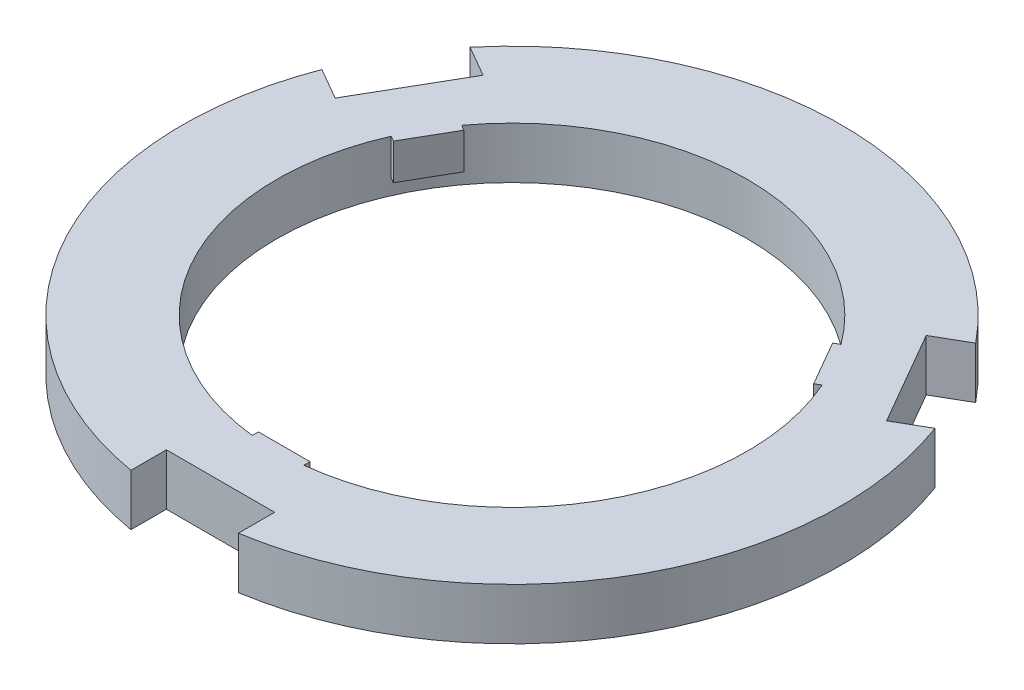
ISO-10303-21;
HEADER;
FILE_DESCRIPTION(('STEP AP214'),'2;1');
FILE_NAME('part.step','',(''),(''),'','','');
FILE_SCHEMA(('AUTOMOTIVE_DESIGN { 1 0 10303 214 1 1 1 1 }'));
ENDSEC;
DATA;
#1=APPLICATION_CONTEXT('core data for automotive mechanical design processes');
#2=APPLICATION_PROTOCOL_DEFINITION('international standard','automotive_design',2000,#1);
#3=PRODUCT_CONTEXT('',#1,'mechanical');
#4=PRODUCT('Part','Part','',(#3));
#5=PRODUCT_RELATED_PRODUCT_CATEGORY('part','',(#4));
#6=PRODUCT_DEFINITION_FORMATION('','',#4);
#7=PRODUCT_DEFINITION_CONTEXT('part definition',#1,'design');
#8=PRODUCT_DEFINITION('design','',#6,#7);
#9=PRODUCT_DEFINITION_SHAPE('','',#8);
#10=(LENGTH_UNIT() NAMED_UNIT(*) SI_UNIT(.MILLI.,.METRE.));
#11=(NAMED_UNIT(*) PLANE_ANGLE_UNIT() SI_UNIT($,.RADIAN.));
#12=(NAMED_UNIT(*) SI_UNIT($,.STERADIAN.) SOLID_ANGLE_UNIT());
#13=UNCERTAINTY_MEASURE_WITH_UNIT(LENGTH_MEASURE(1.E-05),#10,'distance_accuracy_value','');
#14=(GEOMETRIC_REPRESENTATION_CONTEXT(3) GLOBAL_UNCERTAINTY_ASSIGNED_CONTEXT((#13)) GLOBAL_UNIT_ASSIGNED_CONTEXT((#10,
#11,#12)) REPRESENTATION_CONTEXT('',''));
#15=CARTESIAN_POINT('',(0.,0.,0.));
#16=DIRECTION('',(0.,0.,1.));
#17=DIRECTION('',(1.,0.,0.));
#18=AXIS2_PLACEMENT_3D('',#15,#16,#17);
#19=CARTESIAN_POINT('',(0.,3.,0.));
#20=DIRECTION('',(0.,-1.,0.));
#21=DIRECTION('',(0.,0.,-1.));
#22=AXIS2_PLACEMENT_3D('',#19,#20,#21);
#23=CYLINDRICAL_SURFACE('',#22,22.8495146289497);
#24=DIRECTION('',(0.,1.,0.));
#25=VECTOR('',#24,1.);
#26=CARTESIAN_POINT('',(-18.4179175818093,-0.5,-13.5233365235163));
#27=LINE('',#26,#25);
#28=CARTESIAN_POINT('',(-18.4179175818093,-0.5,-13.5233365235162));
#29=VERTEX_POINT('',#28);
#30=CARTESIAN_POINT('',(-18.4179175818093,3.,-13.5233365235163));
#31=VERTEX_POINT('',#30);
#32=EDGE_CURVE('E68',#29,#31,#27,.T.);
#33=ORIENTED_EDGE('',*,*,#32,.F.);
#34=CARTESIAN_POINT('',(0.,-0.5,0.));
#35=DIRECTION('',(0.,1.,0.));
#36=DIRECTION('',(0.,0.,1.));
#37=AXIS2_PLACEMENT_3D('',#34,#35,#36);
#38=CIRCLE('',#37,22.8495146289497);
#39=CARTESIAN_POINT('',(-20.9205117641957,-0.5,-9.18871624889676));
#40=VERTEX_POINT('',#39);
#41=EDGE_CURVE('E63',#29,#40,#38,.T.);
#42=ORIENTED_EDGE('',*,*,#41,.T.);
#43=DIRECTION('',(0.,1.,0.));
#44=VECTOR('',#43,1.);
#45=CARTESIAN_POINT('',(-20.9205117641957,-0.5,-9.18871624889676));
#46=LINE('',#45,#44);
#47=CARTESIAN_POINT('',(-20.9205117641957,3.,-9.18871624889676));
#48=VERTEX_POINT('',#47);
#49=EDGE_CURVE('E223',#40,#48,#46,.T.);
#50=ORIENTED_EDGE('',*,*,#49,.T.);
#51=CARTESIAN_POINT('',(0.,3.,0.));
#52=DIRECTION('',(0.,1.,0.));
#53=DIRECTION('',(0.,0.,1.));
#54=AXIS2_PLACEMENT_3D('',#51,#52,#53);
#55=CIRCLE('',#54,22.8495146289497);
#56=CARTESIAN_POINT('',(-2.50259418238637,3.,22.712052772413));
#57=VERTEX_POINT('',#56);
#58=EDGE_CURVE('E207',#48,#57,#55,.T.);
#59=ORIENTED_EDGE('',*,*,#58,.T.);
#60=DIRECTION('',(0.,-1.,0.));
#61=VECTOR('',#60,1.);
#62=CARTESIAN_POINT('',(-2.50259418238637,3.,22.712052772413));
#63=LINE('',#62,#61);
#64=CARTESIAN_POINT('',(-2.50259418238637,-0.5,22.712052772413));
#65=VERTEX_POINT('',#64);
#66=EDGE_CURVE('E335',#57,#65,#63,.T.);
#67=ORIENTED_EDGE('',*,*,#66,.T.);
#68=CARTESIAN_POINT('',(0.,-0.5,0.));
#69=DIRECTION('',(0.,1.,0.));
#70=DIRECTION('',(0.,0.,1.));
#71=AXIS2_PLACEMENT_3D('',#68,#69,#70);
#72=CIRCLE('',#71,22.8495146289497);
#73=CARTESIAN_POINT('',(2.50259418238637,-0.5,22.712052772413));
#74=VERTEX_POINT('',#73);
#75=EDGE_CURVE('E311',#65,#74,#72,.T.);
#76=ORIENTED_EDGE('',*,*,#75,.T.);
#77=DIRECTION('',(0.,-1.,0.));
#78=VECTOR('',#77,1.);
#79=CARTESIAN_POINT('',(2.50259418238637,3.,22.712052772413));
#80=LINE('',#79,#78);
#81=CARTESIAN_POINT('',(2.50259418238637,3.,22.712052772413));
#82=VERTEX_POINT('',#81);
#83=EDGE_CURVE('E331',#82,#74,#80,.T.);
#84=ORIENTED_EDGE('',*,*,#83,.F.);
#85=CARTESIAN_POINT('',(20.9205117641956,3.,-9.18871624889678));
#86=VERTEX_POINT('',#85);
#87=EDGE_CURVE('E221',#82,#86,#55,.T.);
#88=ORIENTED_EDGE('',*,*,#87,.T.);
#89=DIRECTION('',(0.,-1.,0.));
#90=VECTOR('',#89,1.);
#91=CARTESIAN_POINT('',(20.9205117641956,3.,-9.18871624889678));
#92=LINE('',#91,#90);
#93=CARTESIAN_POINT('',(20.9205117641956,-0.5,-9.18871624889677));
#94=VERTEX_POINT('',#93);
#95=EDGE_CURVE('E241',#86,#94,#92,.T.);
#96=ORIENTED_EDGE('',*,*,#95,.T.);
#97=CARTESIAN_POINT('',(0.,-0.5,0.));
#98=DIRECTION('',(0.,1.,0.));
#99=DIRECTION('',(0.,0.,1.));
#100=AXIS2_PLACEMENT_3D('',#97,#98,#99);
#101=CIRCLE('',#100,22.8495146289497);
#102=CARTESIAN_POINT('',(18.4179175818093,-0.5,-13.5233365235163));
#103=VERTEX_POINT('',#102);
#104=EDGE_CURVE('E267',#94,#103,#101,.T.);
#105=ORIENTED_EDGE('',*,*,#104,.T.);
#106=DIRECTION('',(0.,-1.,0.));
#107=VECTOR('',#106,1.);
#108=CARTESIAN_POINT('',(18.4179175818093,3.,-13.5233365235163));
#109=LINE('',#108,#107);
#110=CARTESIAN_POINT('',(18.4179175818093,3.,-13.5233365235163));
#111=VERTEX_POINT('',#110);
#112=EDGE_CURVE('E297',#111,#103,#109,.T.);
#113=ORIENTED_EDGE('',*,*,#112,.F.);
#114=EDGE_CURVE('E218',#111,#31,#55,.T.);
#115=ORIENTED_EDGE('',*,*,#114,.T.);
#116=EDGE_LOOP('',(#33,#42,#50,#59,#67,#76,#84,#88,#96,#105,#113,#115));
#117=FACE_BOUND('',#116,.T.);
#118=CARTESIAN_POINT('',(0.,-2.,0.));
#119=DIRECTION('',(0.,1.,0.));
#120=DIRECTION('',(0.,0.,1.));
#121=AXIS2_PLACEMENT_3D('',#118,#119,#120);
#122=CIRCLE('',#121,22.8495146289497);
#123=CARTESIAN_POINT('',(0.,-2.,22.8495146289497));
#124=VERTEX_POINT('',#123);
#125=EDGE_CURVE('E387',#124,#124,#122,.T.);
#126=ORIENTED_EDGE('',*,*,#125,.F.);
#127=EDGE_LOOP('',(#126));
#128=FACE_BOUND('',#127,.T.);
#129=ADVANCED_FACE('F47',(#117,#128),#23,.F.);
#130=CARTESIAN_POINT('',(-5.46649150767487,3.,0.));
#131=DIRECTION('',(1.,0.,0.));
#132=DIRECTION('',(0.,0.,-1.));
#133=AXIS2_PLACEMENT_3D('',#130,#131,#132);
#134=PLANE('',#133);
#135=DIRECTION('',(0.,-1.,0.));
#136=VECTOR('',#135,1.);
#137=CARTESIAN_POINT('',(-5.46649150767492,3.,31.5296284563665));
#138=LINE('',#137,#136);
#139=CARTESIAN_POINT('',(-5.46649150767492,3.,31.5296284563665));
#140=VERTEX_POINT('',#139);
#141=CARTESIAN_POINT('',(-5.46649150767492,-2.,31.5296284563665));
#142=VERTEX_POINT('',#141);
#143=EDGE_CURVE('E430',#140,#142,#138,.T.);
#144=ORIENTED_EDGE('',*,*,#143,.T.);
#145=DIRECTION('',(0.,0.,1.));
#146=VECTOR('',#145,1.);
#147=CARTESIAN_POINT('',(-5.46649150767487,-2.,0.));
#148=LINE('',#147,#146);
#149=CARTESIAN_POINT('',(-5.46649150767492,-2.,28.0858274148198));
#150=VERTEX_POINT('',#149);
#151=EDGE_CURVE('E258',#150,#142,#148,.T.);
#152=ORIENTED_EDGE('',*,*,#151,.F.);
#153=DIRECTION('',(0.,-1.,0.));
#154=VECTOR('',#153,1.);
#155=CARTESIAN_POINT('',(-5.46649150767492,3.,28.0858274148198));
#156=LINE('',#155,#154);
#157=CARTESIAN_POINT('',(-5.46649150767492,3.,28.0858274148198));
#158=VERTEX_POINT('',#157);
#159=EDGE_CURVE('E11',#158,#150,#156,.T.);
#160=ORIENTED_EDGE('',*,*,#159,.F.);
#161=DIRECTION('',(0.,0.,1.));
#162=VECTOR('',#161,1.);
#163=CARTESIAN_POINT('',(-5.46649150767487,3.,0.));
#164=LINE('',#163,#162);
#165=EDGE_CURVE('E391',#158,#140,#164,.T.);
#166=ORIENTED_EDGE('',*,*,#165,.T.);
#167=EDGE_LOOP('',(#144,#152,#160,#166));
#168=FACE_BOUND('',#167,.T.);
#169=ADVANCED_FACE('F49',(#168),#134,.T.);
#170=CARTESIAN_POINT('',(0.,3.,28.0858274148198));
#171=DIRECTION('',(0.,0.,-1.));
#172=DIRECTION('',(-1.,0.,0.));
#173=AXIS2_PLACEMENT_3D('',#170,#171,#172);
#174=PLANE('',#173);
#175=ORIENTED_EDGE('',*,*,#159,.T.);
#176=DIRECTION('',(1.,0.,0.));
#177=VECTOR('',#176,1.);
#178=CARTESIAN_POINT('',(0.,-2.,28.0858274148198));
#179=LINE('',#178,#177);
#180=CARTESIAN_POINT('',(5.04054777636176,-2.,28.0858274148198));
#181=VERTEX_POINT('',#180);
#182=EDGE_CURVE('E343',#150,#181,#179,.T.);
#183=ORIENTED_EDGE('',*,*,#182,.T.);
#184=DIRECTION('',(0.,-1.,0.));
#185=VECTOR('',#184,1.);
#186=CARTESIAN_POINT('',(5.04054777636176,3.,28.0858274148198));
#187=LINE('',#186,#185);
#188=CARTESIAN_POINT('',(5.04054777636176,3.,28.0858274148198));
#189=VERTEX_POINT('',#188);
#190=EDGE_CURVE('E56',#189,#181,#187,.T.);
#191=ORIENTED_EDGE('',*,*,#190,.F.);
#192=DIRECTION('',(1.,0.,0.));
#193=VECTOR('',#192,1.);
#194=CARTESIAN_POINT('',(0.,3.,28.0858274148198));
#195=LINE('',#194,#193);
#196=EDGE_CURVE('E395',#158,#189,#195,.T.);
#197=ORIENTED_EDGE('',*,*,#196,.F.);
#198=EDGE_LOOP('',(#175,#183,#191,#197));
#199=FACE_BOUND('',#198,.T.);
#200=ADVANCED_FACE('F473',(#199),#174,.F.);
#201=CARTESIAN_POINT('',(5.04054777636174,3.,0.));
#202=DIRECTION('',(1.,0.,0.));
#203=DIRECTION('',(0.,0.,-1.));
#204=AXIS2_PLACEMENT_3D('',#201,#202,#203);
#205=PLANE('',#204);
#206=ORIENTED_EDGE('',*,*,#190,.T.);
#207=DIRECTION('',(0.,0.,1.));
#208=VECTOR('',#207,1.);
#209=CARTESIAN_POINT('',(5.04054777636174,-2.,0.));
#210=LINE('',#209,#208);
#211=CARTESIAN_POINT('',(5.04054777636177,-2.,31.6005202190441));
#212=VERTEX_POINT('',#211);
#213=EDGE_CURVE('E347',#181,#212,#210,.T.);
#214=ORIENTED_EDGE('',*,*,#213,.T.);
#215=DIRECTION('',(0.,-1.,0.));
#216=VECTOR('',#215,1.);
#217=CARTESIAN_POINT('',(5.04054777636177,3.,31.6005202190441));
#218=LINE('',#217,#216);
#219=CARTESIAN_POINT('',(5.04054777636177,3.,31.6005202190441));
#220=VERTEX_POINT('',#219);
#221=EDGE_CURVE('E457',#220,#212,#218,.T.);
#222=ORIENTED_EDGE('',*,*,#221,.F.);
#223=DIRECTION('',(0.,0.,1.));
#224=VECTOR('',#223,1.);
#225=CARTESIAN_POINT('',(5.04054777636174,3.,0.));
#226=LINE('',#225,#224);
#227=EDGE_CURVE('E398',#189,#220,#226,.T.);
#228=ORIENTED_EDGE('',*,*,#227,.F.);
#229=EDGE_LOOP('',(#206,#214,#222,#228));
#230=FACE_BOUND('',#229,.T.);
#231=ADVANCED_FACE('F464',(#230),#205,.F.);
#232=CARTESIAN_POINT('',(0.,3.,-2.84494650060196E-13));
#233=DIRECTION('',(0.,-1.,0.));
#234=DIRECTION('',(0.,0.,-1.));
#235=AXIS2_PLACEMENT_3D('',#232,#233,#234);
#236=CYLINDRICAL_SURFACE('',#235,32.0000000000001);
#237=ORIENTED_EDGE('',*,*,#221,.T.);
#238=CARTESIAN_POINT('',(0.,-2.,-2.84494650060196E-13));
#239=DIRECTION('',(0.,1.,0.));
#240=DIRECTION('',(0.,0.,1.));
#241=AXIS2_PLACEMENT_3D('',#238,#239,#240);
#242=CIRCLE('',#241,32.0000000000001);
#243=CARTESIAN_POINT('',(30.0387049689356,-2.,-11.0306937129649));
#244=VERTEX_POINT('',#243);
#245=EDGE_CURVE('E351',#212,#244,#242,.T.);
#246=ORIENTED_EDGE('',*,*,#245,.T.);
#247=DIRECTION('',(0.,-1.,0.));
#248=VECTOR('',#247,1.);
#249=CARTESIAN_POINT('',(30.0387049689356,3.,-11.0306937129649));
#250=LINE('',#249,#248);
#251=CARTESIAN_POINT('',(30.0387049689356,3.,-11.0306937129649));
#252=VERTEX_POINT('',#251);
#253=EDGE_CURVE('E454',#252,#244,#250,.T.);
#254=ORIENTED_EDGE('',*,*,#253,.F.);
#255=CARTESIAN_POINT('',(0.,3.,-2.84494650060196E-13));
#256=DIRECTION('',(0.,1.,0.));
#257=DIRECTION('',(0.,0.,1.));
#258=AXIS2_PLACEMENT_3D('',#255,#256,#257);
#259=CIRCLE('',#258,32.0000000000001);
#260=EDGE_CURVE('E401',#220,#252,#259,.T.);
#261=ORIENTED_EDGE('',*,*,#260,.F.);
#262=EDGE_LOOP('',(#237,#246,#254,#261));
#263=FACE_BOUND('',#262,.T.);
#264=ADVANCED_FACE('F517',(#263),#236,.T.);
#265=CARTESIAN_POINT('',(2.73324575383742,3.,4.73412051521833));
#266=DIRECTION('',(-0.499999999999999,0.,-0.866025403784439));
#267=DIRECTION('',(-0.866025403784439,0.,0.499999999999999));
#268=AXIS2_PLACEMENT_3D('',#265,#266,#267);
#269=PLANE('',#268);
#270=ORIENTED_EDGE('',*,*,#253,.T.);
#271=DIRECTION('',(0.86602540378444,0.,-0.499999999999999));
#272=VECTOR('',#271,1.);
#273=CARTESIAN_POINT('',(2.73324575383742,-2.,4.73412051521833));
#274=LINE('',#273,#272);
#275=CARTESIAN_POINT('',(27.0562857813768,-2.,-9.30879319219155));
#276=VERTEX_POINT('',#275);
#277=EDGE_CURVE('E355',#276,#244,#274,.T.);
#278=ORIENTED_EDGE('',*,*,#277,.F.);
#279=DIRECTION('',(0.,-1.,0.));
#280=VECTOR('',#279,1.);
#281=CARTESIAN_POINT('',(27.0562857813768,3.,-9.30879319219155));
#282=LINE('',#281,#280);
#283=CARTESIAN_POINT('',(27.0562857813768,3.,-9.30879319219155));
#284=VERTEX_POINT('',#283);
#285=EDGE_CURVE('E451',#284,#276,#282,.T.);
#286=ORIENTED_EDGE('',*,*,#285,.F.);
#287=DIRECTION('',(0.86602540378444,0.,-0.499999999999999));
#288=VECTOR('',#287,1.);
#289=CARTESIAN_POINT('',(2.73324575383742,3.,4.73412051521833));
#290=LINE('',#289,#288);
#291=EDGE_CURVE('E404',#284,#252,#290,.T.);
#292=ORIENTED_EDGE('',*,*,#291,.T.);
#293=EDGE_LOOP('',(#270,#278,#286,#292));
#294=FACE_BOUND('',#293,.T.);
#295=ADVANCED_FACE('F514',(#294),#269,.T.);
#296=CARTESIAN_POINT('',(24.3230400275394,3.,-14.0429137074099));
#297=DIRECTION('',(-0.866025403784438,0.,0.5));
#298=DIRECTION('',(0.5,0.,0.866025403784439));
#299=AXIS2_PLACEMENT_3D('',#296,#297,#298);
#300=PLANE('',#299);
#301=ORIENTED_EDGE('',*,*,#285,.T.);
#302=DIRECTION('',(-0.5,0.,-0.866025403784438));
#303=VECTOR('',#302,1.);
#304=CARTESIAN_POINT('',(24.3230400275394,-2.,-14.0429137074099));
#305=LINE('',#304,#303);
#306=CARTESIAN_POINT('',(21.8027661393585,-2.,-18.4081561307284));
#307=VERTEX_POINT('',#306);
#308=EDGE_CURVE('E359',#276,#307,#305,.T.);
#309=ORIENTED_EDGE('',*,*,#308,.T.);
#310=DIRECTION('',(0.,-1.,0.));
#311=VECTOR('',#310,1.);
#312=CARTESIAN_POINT('',(21.8027661393585,3.,-18.4081561307284));
#313=LINE('',#312,#311);
#314=CARTESIAN_POINT('',(21.8027661393585,3.,-18.4081561307284));
#315=VERTEX_POINT('',#314);
#316=EDGE_CURVE('E448',#315,#307,#313,.T.);
#317=ORIENTED_EDGE('',*,*,#316,.F.);
#318=DIRECTION('',(-0.5,0.,-0.866025403784438));
#319=VECTOR('',#318,1.);
#320=CARTESIAN_POINT('',(24.3230400275394,3.,-14.0429137074099));
#321=LINE('',#320,#319);
#322=EDGE_CURVE('E408',#284,#315,#321,.T.);
#323=ORIENTED_EDGE('',*,*,#322,.F.);
#324=EDGE_LOOP('',(#301,#309,#317,#323));
#325=FACE_BOUND('',#324,.T.);
#326=ADVANCED_FACE('F509',(#325),#300,.F.);
#327=CARTESIAN_POINT('',(-2.52027388818087,3.,-4.3652424233184));
#328=DIRECTION('',(-0.500000000000002,0.,-0.866025403784438));
#329=DIRECTION('',(-0.866025403784438,0.,0.500000000000002));
#330=AXIS2_PLACEMENT_3D('',#327,#328,#329);
#331=PLANE('',#330);
#332=ORIENTED_EDGE('',*,*,#316,.T.);
#333=DIRECTION('',(0.866025403784438,0.,-0.500000000000002));
#334=VECTOR('',#333,1.);
#335=CARTESIAN_POINT('',(-2.52027388818087,-2.,-4.3652424233184));
#336=LINE('',#335,#334);
#337=CARTESIAN_POINT('',(24.8465793943151,-2.,-20.1655025328405));
#338=VERTEX_POINT('',#337);
#339=EDGE_CURVE('E363',#307,#338,#336,.T.);
#340=ORIENTED_EDGE('',*,*,#339,.T.);
#341=DIRECTION('',(0.,-1.,0.));
#342=VECTOR('',#341,1.);
#343=CARTESIAN_POINT('',(24.8465793943151,3.,-20.1655025328405));
#344=LINE('',#343,#342);
#345=CARTESIAN_POINT('',(24.8465793943151,3.,-20.1655025328405));
#346=VERTEX_POINT('',#345);
#347=EDGE_CURVE('E445',#346,#338,#344,.T.);
#348=ORIENTED_EDGE('',*,*,#347,.F.);
#349=DIRECTION('',(0.866025403784438,0.,-0.500000000000002));
#350=VECTOR('',#349,1.);
#351=CARTESIAN_POINT('',(-2.52027388818087,3.,-4.3652424233184));
#352=LINE('',#351,#350);
#353=EDGE_CURVE('E411',#315,#346,#352,.T.);
#354=ORIENTED_EDGE('',*,*,#353,.F.);
#355=EDGE_LOOP('',(#332,#340,#348,#354));
#356=FACE_BOUND('',#355,.T.);
#357=ADVANCED_FACE('F505',(#356),#331,.F.);
#358=CARTESIAN_POINT('',(0.,3.,0.));
#359=DIRECTION('',(0.,-1.,0.));
#360=DIRECTION('',(0.,0.,-1.));
#361=AXIS2_PLACEMENT_3D('',#358,#359,#360);
#362=CYLINDRICAL_SURFACE('',#361,32.);
#363=ORIENTED_EDGE('',*,*,#347,.T.);
#364=CARTESIAN_POINT('',(0.,-2.,0.));
#365=DIRECTION('',(0.,1.,0.));
#366=DIRECTION('',(0.,0.,1.));
#367=AXIS2_PLACEMENT_3D('',#364,#365,#366);
#368=CIRCLE('',#367,32.);
#369=CARTESIAN_POINT('',(-24.5722134612607,-2.,-20.4989347434016));
#370=VERTEX_POINT('',#369);
#371=EDGE_CURVE('E367',#338,#370,#368,.T.);
#372=ORIENTED_EDGE('',*,*,#371,.T.);
#373=DIRECTION('',(0.,-1.,0.));
#374=VECTOR('',#373,1.);
#375=CARTESIAN_POINT('',(-24.5722134612607,3.,-20.4989347434016));
#376=LINE('',#375,#374);
#377=CARTESIAN_POINT('',(-24.5722134612607,3.,-20.4989347434016));
#378=VERTEX_POINT('',#377);
#379=EDGE_CURVE('E442',#378,#370,#376,.T.);
#380=ORIENTED_EDGE('',*,*,#379,.F.);
#381=CARTESIAN_POINT('',(0.,3.,0.));
#382=DIRECTION('',(0.,1.,0.));
#383=DIRECTION('',(0.,0.,1.));
#384=AXIS2_PLACEMENT_3D('',#381,#382,#383);
#385=CIRCLE('',#384,32.);
#386=EDGE_CURVE('E414',#346,#378,#385,.T.);
#387=ORIENTED_EDGE('',*,*,#386,.F.);
#388=EDGE_LOOP('',(#363,#372,#380,#387));
#389=FACE_BOUND('',#388,.T.);
#390=ADVANCED_FACE('F500',(#389),#362,.T.);
#391=CARTESIAN_POINT('',(2.73324575383744,3.,-4.73412051521831));
#392=DIRECTION('',(-0.500000000000002,0.,0.866025403784438));
#393=DIRECTION('',(0.866025403784438,0.,0.500000000000002));
#394=AXIS2_PLACEMENT_3D('',#391,#392,#393);
#395=PLANE('',#394);
#396=ORIENTED_EDGE('',*,*,#379,.T.);
#397=DIRECTION('',(-0.866025403784438,0.,-0.500000000000002));
#398=VECTOR('',#397,1.);
#399=CARTESIAN_POINT('',(2.73324575383744,-2.,-4.73412051521831));
#400=LINE('',#399,#398);
#401=CARTESIAN_POINT('',(-21.5897942737019,-2.,-18.7770342226283));
#402=VERTEX_POINT('',#401);
#403=EDGE_CURVE('E371',#402,#370,#400,.T.);
#404=ORIENTED_EDGE('',*,*,#403,.F.);
#405=DIRECTION('',(0.,-1.,0.));
#406=VECTOR('',#405,1.);
#407=CARTESIAN_POINT('',(-21.5897942737019,3.,-18.7770342226283));
#408=LINE('',#407,#406);
#409=CARTESIAN_POINT('',(-21.5897942737019,3.,-18.7770342226283));
#410=VERTEX_POINT('',#409);
#411=EDGE_CURVE('E439',#410,#402,#408,.T.);
#412=ORIENTED_EDGE('',*,*,#411,.F.);
#413=DIRECTION('',(-0.866025403784438,0.,-0.500000000000002));
#414=VECTOR('',#413,1.);
#415=CARTESIAN_POINT('',(2.73324575383744,3.,-4.73412051521831));
#416=LINE('',#415,#414);
#417=EDGE_CURVE('E417',#410,#378,#416,.T.);
#418=ORIENTED_EDGE('',*,*,#417,.T.);
#419=EDGE_LOOP('',(#396,#404,#412,#418));
#420=FACE_BOUND('',#419,.T.);
#421=ADVANCED_FACE('F495',(#420),#395,.T.);
#422=CARTESIAN_POINT('',(-24.3230400275394,3.,-14.0429137074099));
#423=DIRECTION('',(0.866025403784439,0.,0.5));
#424=DIRECTION('',(0.5,0.,-0.866025403784439));
#425=AXIS2_PLACEMENT_3D('',#422,#423,#424);
#426=PLANE('',#425);
#427=ORIENTED_EDGE('',*,*,#411,.T.);
#428=DIRECTION('',(-0.5,0.,0.866025403784439));
#429=VECTOR('',#428,1.);
#430=CARTESIAN_POINT('',(-24.3230400275394,-2.,-14.0429137074099));
#431=LINE('',#430,#429);
#432=CARTESIAN_POINT('',(-26.8433139157203,-2.,-9.67767128409147));
#433=VERTEX_POINT('',#432);
#434=EDGE_CURVE('E375',#402,#433,#431,.T.);
#435=ORIENTED_EDGE('',*,*,#434,.T.);
#436=DIRECTION('',(0.,-1.,0.));
#437=VECTOR('',#436,1.);
#438=CARTESIAN_POINT('',(-26.8433139157203,3.,-9.67767128409147));
#439=LINE('',#438,#437);
#440=CARTESIAN_POINT('',(-26.8433139157203,3.,-9.67767128409147));
#441=VERTEX_POINT('',#440);
#442=EDGE_CURVE('E436',#441,#433,#439,.T.);
#443=ORIENTED_EDGE('',*,*,#442,.F.);
#444=DIRECTION('',(-0.5,0.,0.866025403784439));
#445=VECTOR('',#444,1.);
#446=CARTESIAN_POINT('',(-24.3230400275394,3.,-14.0429137074099));
#447=LINE('',#446,#445);
#448=EDGE_CURVE('E421',#410,#441,#447,.T.);
#449=ORIENTED_EDGE('',*,*,#448,.F.);
#450=EDGE_LOOP('',(#427,#435,#443,#449));
#451=FACE_BOUND('',#450,.T.);
#452=ADVANCED_FACE('F490',(#451),#426,.F.);
#453=CARTESIAN_POINT('',(-2.52027388818073,3.,4.36524242331827));
#454=DIRECTION('',(-0.499999999999993,0.,0.866025403784442));
#455=DIRECTION('',(0.866025403784443,0.,0.499999999999994));
#456=AXIS2_PLACEMENT_3D('',#453,#454,#455);
#457=PLANE('',#456);
#458=ORIENTED_EDGE('',*,*,#442,.T.);
#459=DIRECTION('',(-0.866025403784442,0.,-0.499999999999994));
#460=VECTOR('',#459,1.);
#461=CARTESIAN_POINT('',(-2.52027388818073,-2.,4.36524242331827));
#462=LINE('',#461,#460);
#463=CARTESIAN_POINT('',(-29.8871271706769,-2.,-11.4350176862036));
#464=VERTEX_POINT('',#463);
#465=EDGE_CURVE('E379',#433,#464,#462,.T.);
#466=ORIENTED_EDGE('',*,*,#465,.T.);
#467=DIRECTION('',(0.,-1.,0.));
#468=VECTOR('',#467,1.);
#469=CARTESIAN_POINT('',(-29.8871271706769,3.,-11.4350176862036));
#470=LINE('',#469,#468);
#471=CARTESIAN_POINT('',(-29.8871271706769,3.,-11.4350176862036));
#472=VERTEX_POINT('',#471);
#473=EDGE_CURVE('E433',#472,#464,#470,.T.);
#474=ORIENTED_EDGE('',*,*,#473,.F.);
#475=DIRECTION('',(-0.866025403784442,0.,-0.499999999999994));
#476=VECTOR('',#475,1.);
#477=CARTESIAN_POINT('',(-2.52027388818073,3.,4.36524242331827));
#478=LINE('',#477,#476);
#479=EDGE_CURVE('E424',#441,#472,#478,.T.);
#480=ORIENTED_EDGE('',*,*,#479,.F.);
#481=EDGE_LOOP('',(#458,#466,#474,#480));
#482=FACE_BOUND('',#481,.T.);
#483=ADVANCED_FACE('F486',(#482),#457,.F.);
#484=CARTESIAN_POINT('',(0.,3.,-2.84494650060196E-13));
#485=DIRECTION('',(0.,-1.,0.));
#486=DIRECTION('',(0.,0.,-1.));
#487=AXIS2_PLACEMENT_3D('',#484,#485,#486);
#488=CYLINDRICAL_SURFACE('',#487,32.0000000000001);
#489=ORIENTED_EDGE('',*,*,#473,.T.);
#490=CARTESIAN_POINT('',(0.,-2.,-2.84494650060196E-13));
#491=DIRECTION('',(0.,1.,0.));
#492=DIRECTION('',(0.,0.,1.));
#493=AXIS2_PLACEMENT_3D('',#490,#491,#492);
#494=CIRCLE('',#493,32.0000000000001);
#495=EDGE_CURVE('E383',#464,#142,#494,.T.);
#496=ORIENTED_EDGE('',*,*,#495,.T.);
#497=ORIENTED_EDGE('',*,*,#143,.F.);
#498=CARTESIAN_POINT('',(0.,3.,-2.84494650060196E-13));
#499=DIRECTION('',(0.,1.,0.));
#500=DIRECTION('',(0.,0.,1.));
#501=AXIS2_PLACEMENT_3D('',#498,#499,#500);
#502=CIRCLE('',#501,32.0000000000001);
#503=EDGE_CURVE('E219',#472,#140,#502,.T.);
#504=ORIENTED_EDGE('',*,*,#503,.F.);
#505=EDGE_LOOP('',(#489,#496,#497,#504));
#506=FACE_BOUND('',#505,.T.);
#507=ADVANCED_FACE('F481',(#506),#488,.T.);
#508=CARTESIAN_POINT('',(0.,3.,0.));
#509=DIRECTION('',(0.,1.,0.));
#510=DIRECTION('',(0.,0.,1.));
#511=AXIS2_PLACEMENT_3D('',#508,#509,#510);
#512=PLANE('',#511);
#513=ORIENTED_EDGE('',*,*,#165,.F.);
#514=ORIENTED_EDGE('',*,*,#196,.T.);
#515=ORIENTED_EDGE('',*,*,#227,.T.);
#516=ORIENTED_EDGE('',*,*,#260,.T.);
#517=ORIENTED_EDGE('',*,*,#291,.F.);
#518=ORIENTED_EDGE('',*,*,#322,.T.);
#519=ORIENTED_EDGE('',*,*,#353,.T.);
#520=ORIENTED_EDGE('',*,*,#386,.T.);
#521=ORIENTED_EDGE('',*,*,#417,.F.);
#522=ORIENTED_EDGE('',*,*,#448,.T.);
#523=ORIENTED_EDGE('',*,*,#479,.T.);
#524=ORIENTED_EDGE('',*,*,#503,.T.);
#525=EDGE_LOOP('',(#513,#514,#515,#516,#517,#518,#519,#520,#521,#522,#523,#524));
#526=FACE_BOUND('',#525,.T.);
#527=ORIENTED_EDGE('',*,*,#87,.F.);
#528=DIRECTION('',(0.,0.,1.));
#529=VECTOR('',#528,1.);
#530=CARTESIAN_POINT('',(2.50259418238636,3.,0.));
#531=LINE('',#530,#529);
#532=CARTESIAN_POINT('',(2.50259418238637,3.,22.112052772413));
#533=VERTEX_POINT('',#532);
#534=EDGE_CURVE('E324',#533,#82,#531,.T.);
#535=ORIENTED_EDGE('',*,*,#534,.F.);
#536=DIRECTION('',(1.,0.,0.));
#537=VECTOR('',#536,1.);
#538=CARTESIAN_POINT('',(0.,3.,22.112052772413));
#539=LINE('',#538,#537);
#540=CARTESIAN_POINT('',(-2.50259418238637,3.,22.112052772413));
#541=VERTEX_POINT('',#540);
#542=EDGE_CURVE('E318',#541,#533,#539,.T.);
#543=ORIENTED_EDGE('',*,*,#542,.F.);
#544=DIRECTION('',(0.,0.,1.));
#545=VECTOR('',#544,1.);
#546=CARTESIAN_POINT('',(-2.50259418238636,3.,0.));
#547=LINE('',#546,#545);
#548=EDGE_CURVE('E215',#541,#57,#547,.T.);
#549=ORIENTED_EDGE('',*,*,#548,.T.);
#550=ORIENTED_EDGE('',*,*,#58,.F.);
#551=DIRECTION('',(-0.866025403784443,0.,-0.499999999999993));
#552=VECTOR('',#551,1.);
#553=CARTESIAN_POINT('',(-1.25129709119308,3.,2.1673101373096));
#554=LINE('',#553,#552);
#555=CARTESIAN_POINT('',(-20.400896521925,3.,-8.88871624889676));
#556=VERTEX_POINT('',#555);
#557=EDGE_CURVE('E211',#556,#48,#554,.T.);
#558=ORIENTED_EDGE('',*,*,#557,.F.);
#559=DIRECTION('',(-0.5,0.,0.866025403784439));
#560=VECTOR('',#559,1.);
#561=CARTESIAN_POINT('',(-19.1495994307318,3.,-11.0560263862065));
#562=LINE('',#561,#560);
#563=CARTESIAN_POINT('',(-17.8983023395386,3.,-13.2233365235163));
#564=VERTEX_POINT('',#563);
#565=EDGE_CURVE('E233',#564,#556,#562,.T.);
#566=ORIENTED_EDGE('',*,*,#565,.F.);
#567=DIRECTION('',(-0.86602540378444,0.,-0.499999999999998));
#568=VECTOR('',#567,1.);
#569=CARTESIAN_POINT('',(1.25129709119321,3.,-2.1673101373098));
#570=LINE('',#569,#568);
#571=EDGE_CURVE('E234',#564,#31,#570,.T.);
#572=ORIENTED_EDGE('',*,*,#571,.T.);
#573=ORIENTED_EDGE('',*,*,#114,.F.);
#574=DIRECTION('',(0.866025403784437,0.,-0.500000000000002));
#575=VECTOR('',#574,1.);
#576=CARTESIAN_POINT('',(-1.25129709119317,3.,-2.1673101373097));
#577=LINE('',#576,#575);
#578=CARTESIAN_POINT('',(17.8983023395386,3.,-13.2233365235163));
#579=VERTEX_POINT('',#578);
#580=EDGE_CURVE('E283',#579,#111,#577,.T.);
#581=ORIENTED_EDGE('',*,*,#580,.F.);
#582=DIRECTION('',(-0.5,0.,-0.866025403784438));
#583=VECTOR('',#582,1.);
#584=CARTESIAN_POINT('',(19.1495994307318,3.,-11.0560263862065));
#585=LINE('',#584,#583);
#586=CARTESIAN_POINT('',(20.400896521925,3.,-8.88871624889677));
#587=VERTEX_POINT('',#586);
#588=EDGE_CURVE('E287',#587,#579,#585,.T.);
#589=ORIENTED_EDGE('',*,*,#588,.F.);
#590=DIRECTION('',(0.866025403784439,0.,-0.5));
#591=VECTOR('',#590,1.);
#592=CARTESIAN_POINT('',(1.25129709119318,3.,2.16731013730974));
#593=LINE('',#592,#591);
#594=EDGE_CURVE('E279',#587,#86,#593,.T.);
#595=ORIENTED_EDGE('',*,*,#594,.T.);
#596=EDGE_LOOP('',(#527,#535,#543,#549,#550,#558,#566,#572,#573,#581,#589,#595));
#597=FACE_BOUND('',#596,.T.);
#598=ADVANCED_FACE('F208',(#526,#597),#512,.T.);
#599=CARTESIAN_POINT('',(0.,-2.,0.));
#600=DIRECTION('',(0.,1.,0.));
#601=DIRECTION('',(0.,0.,1.));
#602=AXIS2_PLACEMENT_3D('',#599,#600,#601);
#603=PLANE('',#602);
#604=ORIENTED_EDGE('',*,*,#151,.T.);
#605=ORIENTED_EDGE('',*,*,#495,.F.);
#606=ORIENTED_EDGE('',*,*,#465,.F.);
#607=ORIENTED_EDGE('',*,*,#434,.F.);
#608=ORIENTED_EDGE('',*,*,#403,.T.);
#609=ORIENTED_EDGE('',*,*,#371,.F.);
#610=ORIENTED_EDGE('',*,*,#339,.F.);
#611=ORIENTED_EDGE('',*,*,#308,.F.);
#612=ORIENTED_EDGE('',*,*,#277,.T.);
#613=ORIENTED_EDGE('',*,*,#245,.F.);
#614=ORIENTED_EDGE('',*,*,#213,.F.);
#615=ORIENTED_EDGE('',*,*,#182,.F.);
#616=EDGE_LOOP('',(#604,#605,#606,#607,#608,#609,#610,#611,#612,#613,#614,#615));
#617=FACE_BOUND('',#616,.T.);
#618=ORIENTED_EDGE('',*,*,#125,.T.);
#619=EDGE_LOOP('',(#618));
#620=FACE_BOUND('',#619,.T.);
#621=ADVANCED_FACE('F471',(#617,#620),#603,.F.);
#622=CARTESIAN_POINT('',(0.,3.,22.112052772413));
#623=DIRECTION('',(0.,0.,-1.));
#624=DIRECTION('',(-1.,0.,0.));
#625=AXIS2_PLACEMENT_3D('',#622,#623,#624);
#626=PLANE('',#625);
#627=DIRECTION('',(0.,-1.,0.));
#628=VECTOR('',#627,1.);
#629=CARTESIAN_POINT('',(2.50259418238637,3.,22.112052772413));
#630=LINE('',#629,#628);
#631=CARTESIAN_POINT('',(2.50259418238637,-0.5,22.112052772413));
#632=VERTEX_POINT('',#631);
#633=EDGE_CURVE('E328',#533,#632,#630,.T.);
#634=ORIENTED_EDGE('',*,*,#633,.T.);
#635=DIRECTION('',(1.,0.,0.));
#636=VECTOR('',#635,1.);
#637=CARTESIAN_POINT('',(0.,-0.5,22.112052772413));
#638=LINE('',#637,#636);
#639=CARTESIAN_POINT('',(-2.50259418238637,-0.5,22.112052772413));
#640=VERTEX_POINT('',#639);
#641=EDGE_CURVE('E303',#640,#632,#638,.T.);
#642=ORIENTED_EDGE('',*,*,#641,.F.);
#643=DIRECTION('',(0.,-1.,0.));
#644=VECTOR('',#643,1.);
#645=CARTESIAN_POINT('',(-2.50259418238637,3.,22.112052772413));
#646=LINE('',#645,#644);
#647=EDGE_CURVE('E268',#541,#640,#646,.T.);
#648=ORIENTED_EDGE('',*,*,#647,.F.);
#649=ORIENTED_EDGE('',*,*,#542,.T.);
#650=EDGE_LOOP('',(#634,#642,#648,#649));
#651=FACE_BOUND('',#650,.T.);
#652=ADVANCED_FACE('F527',(#651),#626,.T.);
#653=CARTESIAN_POINT('',(-2.50259418238636,3.,0.));
#654=DIRECTION('',(1.,0.,0.));
#655=DIRECTION('',(0.,0.,-1.));
#656=AXIS2_PLACEMENT_3D('',#653,#654,#655);
#657=PLANE('',#656);
#658=ORIENTED_EDGE('',*,*,#647,.T.);
#659=DIRECTION('',(0.,0.,1.));
#660=VECTOR('',#659,1.);
#661=CARTESIAN_POINT('',(-2.50259418238636,-0.5,0.));
#662=LINE('',#661,#660);
#663=EDGE_CURVE('E307',#640,#65,#662,.T.);
#664=ORIENTED_EDGE('',*,*,#663,.T.);
#665=ORIENTED_EDGE('',*,*,#66,.F.);
#666=ORIENTED_EDGE('',*,*,#548,.F.);
#667=EDGE_LOOP('',(#658,#664,#665,#666));
#668=FACE_BOUND('',#667,.T.);
#669=ADVANCED_FACE('F662',(#668),#657,.F.);
#670=CARTESIAN_POINT('',(2.50259418238636,3.,0.));
#671=DIRECTION('',(1.,0.,0.));
#672=DIRECTION('',(0.,0.,-1.));
#673=AXIS2_PLACEMENT_3D('',#670,#671,#672);
#674=PLANE('',#673);
#675=ORIENTED_EDGE('',*,*,#83,.T.);
#676=DIRECTION('',(0.,0.,1.));
#677=VECTOR('',#676,1.);
#678=CARTESIAN_POINT('',(2.50259418238636,-0.5,0.));
#679=LINE('',#678,#677);
#680=EDGE_CURVE('E314',#632,#74,#679,.T.);
#681=ORIENTED_EDGE('',*,*,#680,.F.);
#682=ORIENTED_EDGE('',*,*,#633,.F.);
#683=ORIENTED_EDGE('',*,*,#534,.T.);
#684=EDGE_LOOP('',(#675,#681,#682,#683));
#685=FACE_BOUND('',#684,.T.);
#686=ADVANCED_FACE('F675',(#685),#674,.T.);
#687=CARTESIAN_POINT('',(0.,-0.5,0.));
#688=DIRECTION('',(0.,1.,0.));
#689=DIRECTION('',(0.,0.,1.));
#690=AXIS2_PLACEMENT_3D('',#687,#688,#689);
#691=PLANE('',#690);
#692=ORIENTED_EDGE('',*,*,#641,.T.);
#693=ORIENTED_EDGE('',*,*,#680,.T.);
#694=ORIENTED_EDGE('',*,*,#75,.F.);
#695=ORIENTED_EDGE('',*,*,#663,.F.);
#696=EDGE_LOOP('',(#692,#693,#694,#695));
#697=FACE_BOUND('',#696,.T.);
#698=ADVANCED_FACE('F688',(#697),#691,.F.);
#699=CARTESIAN_POINT('',(1.25129709119318,3.,2.16731013730974));
#700=DIRECTION('',(-0.5,0.,-0.866025403784438));
#701=DIRECTION('',(-0.866025403784439,0.,0.5));
#702=AXIS2_PLACEMENT_3D('',#699,#700,#701);
#703=PLANE('',#702);
#704=DIRECTION('',(0.,-1.,0.));
#705=VECTOR('',#704,1.);
#706=CARTESIAN_POINT('',(20.400896521925,3.,-8.88871624889677));
#707=LINE('',#706,#705);
#708=CARTESIAN_POINT('',(20.400896521925,-0.5,-8.88871624889677));
#709=VERTEX_POINT('',#708);
#710=EDGE_CURVE('E291',#587,#709,#707,.T.);
#711=ORIENTED_EDGE('',*,*,#710,.T.);
#712=DIRECTION('',(0.866025403784439,0.,-0.5));
#713=VECTOR('',#712,1.);
#714=CARTESIAN_POINT('',(1.25129709119318,-0.5,2.16731013730974));
#715=LINE('',#714,#713);
#716=EDGE_CURVE('E263',#709,#94,#715,.T.);
#717=ORIENTED_EDGE('',*,*,#716,.T.);
#718=ORIENTED_EDGE('',*,*,#95,.F.);
#719=ORIENTED_EDGE('',*,*,#594,.F.);
#720=EDGE_LOOP('',(#711,#717,#718,#719));
#721=FACE_BOUND('',#720,.T.);
#722=ADVANCED_FACE('F701',(#721),#703,.F.);
#723=CARTESIAN_POINT('',(-1.25129709119317,3.,-2.1673101373097));
#724=DIRECTION('',(-0.500000000000002,0.,-0.866025403784437));
#725=DIRECTION('',(-0.866025403784437,0.,0.500000000000002));
#726=AXIS2_PLACEMENT_3D('',#723,#724,#725);
#727=PLANE('',#726);
#728=ORIENTED_EDGE('',*,*,#112,.T.);
#729=DIRECTION('',(0.866025403784437,0.,-0.500000000000002));
#730=VECTOR('',#729,1.);
#731=CARTESIAN_POINT('',(-1.25129709119317,-0.5,-2.1673101373097));
#732=LINE('',#731,#730);
#733=CARTESIAN_POINT('',(17.8983023395386,-0.5,-13.2233365235163));
#734=VERTEX_POINT('',#733);
#735=EDGE_CURVE('E271',#734,#103,#732,.T.);
#736=ORIENTED_EDGE('',*,*,#735,.F.);
#737=DIRECTION('',(0.,-1.,0.));
#738=VECTOR('',#737,1.);
#739=CARTESIAN_POINT('',(17.8983023395386,3.,-13.2233365235163));
#740=LINE('',#739,#738);
#741=EDGE_CURVE('E294',#579,#734,#740,.T.);
#742=ORIENTED_EDGE('',*,*,#741,.F.);
#743=ORIENTED_EDGE('',*,*,#580,.T.);
#744=EDGE_LOOP('',(#728,#736,#742,#743));
#745=FACE_BOUND('',#744,.T.);
#746=ADVANCED_FACE('F714',(#745),#727,.T.);
#747=CARTESIAN_POINT('',(19.1495994307318,3.,-11.0560263862065));
#748=DIRECTION('',(-0.866025403784438,0.,0.500000000000001));
#749=DIRECTION('',(0.500000000000001,0.,0.866025403784438));
#750=AXIS2_PLACEMENT_3D('',#747,#748,#749);
#751=PLANE('',#750);
#752=ORIENTED_EDGE('',*,*,#741,.T.);
#753=DIRECTION('',(-0.5,0.,-0.866025403784438));
#754=VECTOR('',#753,1.);
#755=CARTESIAN_POINT('',(19.1495994307318,-0.5,-11.0560263862065));
#756=LINE('',#755,#754);
#757=EDGE_CURVE('E275',#709,#734,#756,.T.);
#758=ORIENTED_EDGE('',*,*,#757,.F.);
#759=ORIENTED_EDGE('',*,*,#710,.F.);
#760=ORIENTED_EDGE('',*,*,#588,.T.);
#761=EDGE_LOOP('',(#752,#758,#759,#760));
#762=FACE_BOUND('',#761,.T.);
#763=ADVANCED_FACE('F727',(#762),#751,.T.);
#764=CARTESIAN_POINT('',(0.,-0.5,0.));
#765=DIRECTION('',(0.,1.,0.));
#766=DIRECTION('',(0.,0.,1.));
#767=AXIS2_PLACEMENT_3D('',#764,#765,#766);
#768=PLANE('',#767);
#769=ORIENTED_EDGE('',*,*,#716,.F.);
#770=ORIENTED_EDGE('',*,*,#757,.T.);
#771=ORIENTED_EDGE('',*,*,#735,.T.);
#772=ORIENTED_EDGE('',*,*,#104,.F.);
#773=EDGE_LOOP('',(#769,#770,#771,#772));
#774=FACE_BOUND('',#773,.T.);
#775=ADVANCED_FACE('F740',(#774),#768,.F.);
#776=CARTESIAN_POINT('',(1.25129709119321,-0.5,-2.1673101373098));
#777=DIRECTION('',(0.499999999999998,0.,-0.86602540378444));
#778=DIRECTION('',(-0.86602540378444,0.,-0.499999999999998));
#779=AXIS2_PLACEMENT_3D('',#776,#777,#778);
#780=PLANE('',#779);
#781=ORIENTED_EDGE('',*,*,#571,.F.);
#782=DIRECTION('',(0.,1.,0.));
#783=VECTOR('',#782,1.);
#784=CARTESIAN_POINT('',(-17.8983023395386,-0.5,-13.2233365235163));
#785=LINE('',#784,#783);
#786=CARTESIAN_POINT('',(-17.8983023395386,-0.5,-13.2233365235163));
#787=VERTEX_POINT('',#786);
#788=EDGE_CURVE('E255',#787,#564,#785,.T.);
#789=ORIENTED_EDGE('',*,*,#788,.F.);
#790=DIRECTION('',(-0.86602540378444,0.,-0.499999999999998));
#791=VECTOR('',#790,1.);
#792=CARTESIAN_POINT('',(1.25129709119321,-0.5,-2.1673101373098));
#793=LINE('',#792,#791);
#794=EDGE_CURVE('E238',#787,#29,#793,.T.);
#795=ORIENTED_EDGE('',*,*,#794,.T.);
#796=ORIENTED_EDGE('',*,*,#32,.T.);
#797=EDGE_LOOP('',(#781,#789,#795,#796));
#798=FACE_BOUND('',#797,.T.);
#799=ADVANCED_FACE('F753',(#798),#780,.T.);
#800=CARTESIAN_POINT('',(-19.1495994307318,-0.5,-11.0560263862065));
#801=DIRECTION('',(-0.866025403784439,0.,-0.5));
#802=DIRECTION('',(-0.5,0.,0.866025403784439));
#803=AXIS2_PLACEMENT_3D('',#800,#801,#802);
#804=PLANE('',#803);
#805=ORIENTED_EDGE('',*,*,#565,.T.);
#806=DIRECTION('',(0.,1.,0.));
#807=VECTOR('',#806,1.);
#808=CARTESIAN_POINT('',(-20.400896521925,-0.5,-8.88871624889676));
#809=LINE('',#808,#807);
#810=CARTESIAN_POINT('',(-20.400896521925,-0.5,-8.88871624889676));
#811=VERTEX_POINT('',#810);
#812=EDGE_CURVE('E228',#811,#556,#809,.T.);
#813=ORIENTED_EDGE('',*,*,#812,.F.);
#814=DIRECTION('',(-0.5,0.,0.866025403784439));
#815=VECTOR('',#814,1.);
#816=CARTESIAN_POINT('',(-19.1495994307318,-0.5,-11.0560263862065));
#817=LINE('',#816,#815);
#818=EDGE_CURVE('E252',#787,#811,#817,.T.);
#819=ORIENTED_EDGE('',*,*,#818,.F.);
#820=ORIENTED_EDGE('',*,*,#788,.T.);
#821=EDGE_LOOP('',(#805,#813,#819,#820));
#822=FACE_BOUND('',#821,.T.);
#823=ADVANCED_FACE('F763',(#822),#804,.F.);
#824=CARTESIAN_POINT('',(-1.25129709119308,-0.5,2.1673101373096));
#825=DIRECTION('',(0.499999999999993,0.,-0.866025403784443));
#826=DIRECTION('',(-0.866025403784443,0.,-0.499999999999993));
#827=AXIS2_PLACEMENT_3D('',#824,#825,#826);
#828=PLANE('',#827);
#829=ORIENTED_EDGE('',*,*,#557,.T.);
#830=ORIENTED_EDGE('',*,*,#49,.F.);
#831=DIRECTION('',(-0.866025403784443,0.,-0.499999999999993));
#832=VECTOR('',#831,1.);
#833=CARTESIAN_POINT('',(-1.25129709119308,-0.5,2.1673101373096));
#834=LINE('',#833,#832);
#835=EDGE_CURVE('E249',#811,#40,#834,.T.);
#836=ORIENTED_EDGE('',*,*,#835,.F.);
#837=ORIENTED_EDGE('',*,*,#812,.T.);
#838=EDGE_LOOP('',(#829,#830,#836,#837));
#839=FACE_BOUND('',#838,.T.);
#840=ADVANCED_FACE('F230',(#839),#828,.F.);
#841=CARTESIAN_POINT('',(0.,-0.5,0.));
#842=DIRECTION('',(0.,1.,0.));
#843=DIRECTION('',(0.,0.,1.));
#844=AXIS2_PLACEMENT_3D('',#841,#842,#843);
#845=PLANE('',#844);
#846=ORIENTED_EDGE('',*,*,#794,.F.);
#847=ORIENTED_EDGE('',*,*,#818,.T.);
#848=ORIENTED_EDGE('',*,*,#835,.T.);
#849=ORIENTED_EDGE('',*,*,#41,.F.);
#850=EDGE_LOOP('',(#846,#847,#848,#849));
#851=FACE_BOUND('',#850,.T.);
#852=ADVANCED_FACE('F782',(#851),#845,.F.);
#853=CLOSED_SHELL('',(#129,#169,#200,#231,#264,#295,#326,#357,#390,#421,#452,#483,#507,#598,
#621,#652,#669,#686,#698,#722,#746,#763,#775,#799,#823,#840,#852));
#854=MANIFOLD_SOLID_BREP('B2',#853);
#855=ADVANCED_BREP_SHAPE_REPRESENTATION('',(#18,#854),#14);
#856=SHAPE_DEFINITION_REPRESENTATION(#9,#855);
ENDSEC;
END-ISO-10303-21;
